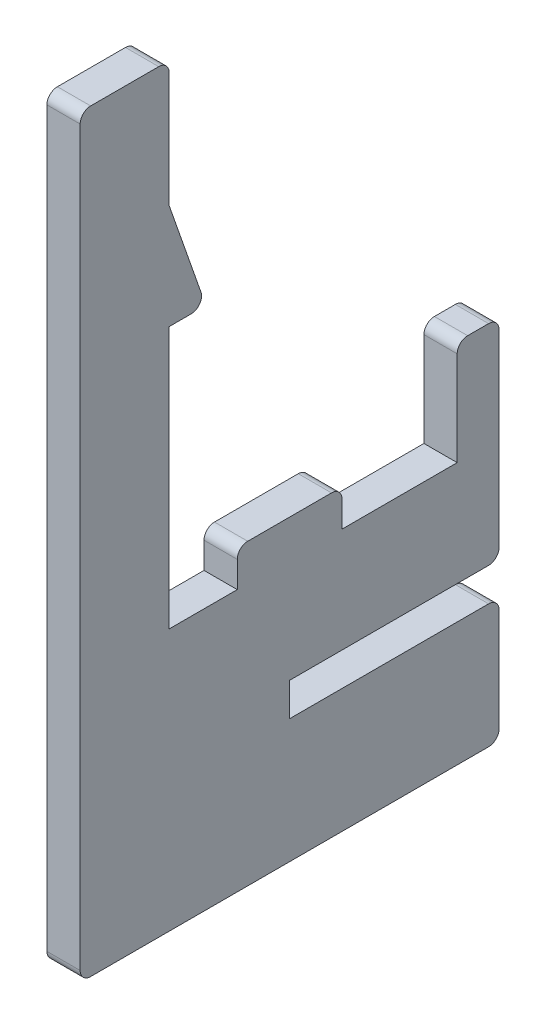
ISO-10303-21;
HEADER;
FILE_DESCRIPTION(('STEP AP214'),'2;1');
FILE_NAME('part.step','',(''),(''),'','','');
FILE_SCHEMA(('AUTOMOTIVE_DESIGN { 1 0 10303 214 1 1 1 1 }'));
ENDSEC;
DATA;
#1=APPLICATION_CONTEXT('core data for automotive mechanical design processes');
#2=APPLICATION_PROTOCOL_DEFINITION('international standard','automotive_design',2000,#1);
#3=PRODUCT_CONTEXT('',#1,'mechanical');
#4=PRODUCT('Part','Part','',(#3));
#5=PRODUCT_RELATED_PRODUCT_CATEGORY('part','',(#4));
#6=PRODUCT_DEFINITION_FORMATION('','',#4);
#7=PRODUCT_DEFINITION_CONTEXT('part definition',#1,'design');
#8=PRODUCT_DEFINITION('design','',#6,#7);
#9=PRODUCT_DEFINITION_SHAPE('','',#8);
#10=(LENGTH_UNIT() NAMED_UNIT(*) SI_UNIT(.MILLI.,.METRE.));
#11=(NAMED_UNIT(*) PLANE_ANGLE_UNIT() SI_UNIT($,.RADIAN.));
#12=(NAMED_UNIT(*) SI_UNIT($,.STERADIAN.) SOLID_ANGLE_UNIT());
#13=UNCERTAINTY_MEASURE_WITH_UNIT(LENGTH_MEASURE(1.E-05),#10,'distance_accuracy_value','');
#14=(GEOMETRIC_REPRESENTATION_CONTEXT(3) GLOBAL_UNCERTAINTY_ASSIGNED_CONTEXT((#13)) GLOBAL_UNIT_ASSIGNED_CONTEXT((#10,
#11,#12)) REPRESENTATION_CONTEXT('',''));
#15=CARTESIAN_POINT('',(0.,0.,0.));
#16=DIRECTION('',(0.,0.,1.));
#17=DIRECTION('',(1.,0.,0.));
#18=AXIS2_PLACEMENT_3D('',#15,#16,#17);
#19=CARTESIAN_POINT('',(3.175,47.,0.));
#20=DIRECTION('',(0.,-1.,0.));
#21=DIRECTION('',(0.,0.,-1.));
#22=AXIS2_PLACEMENT_3D('',#19,#20,#21);
#23=PLANE('',#22);
#24=DIRECTION('',(0.,0.,1.));
#25=VECTOR('',#24,1.);
#26=CARTESIAN_POINT('',(0.,47.,0.));
#27=LINE('',#26,#25);
#28=CARTESIAN_POINT('',(0.,47.,1.));
#29=VERTEX_POINT('',#28);
#30=CARTESIAN_POINT('',(0.,47.,7.5));
#31=VERTEX_POINT('',#30);
#32=EDGE_CURVE('E298',#29,#31,#27,.T.);
#33=ORIENTED_EDGE('',*,*,#32,.T.);
#34=DIRECTION('',(-1.,0.,0.));
#35=VECTOR('',#34,1.);
#36=CARTESIAN_POINT('',(3.175,47.,7.5));
#37=LINE('',#36,#35);
#38=CARTESIAN_POINT('',(3.175,47.,7.5));
#39=VERTEX_POINT('',#38);
#40=EDGE_CURVE('E446',#31,#39,#37,.F.);
#41=ORIENTED_EDGE('',*,*,#40,.T.);
#42=DIRECTION('',(0.,0.,1.));
#43=VECTOR('',#42,1.);
#44=CARTESIAN_POINT('',(3.175,47.,0.));
#45=LINE('',#44,#43);
#46=CARTESIAN_POINT('',(3.175,47.,1.));
#47=VERTEX_POINT('',#46);
#48=EDGE_CURVE('E347',#47,#39,#45,.T.);
#49=ORIENTED_EDGE('',*,*,#48,.F.);
#50=DIRECTION('',(-1.,0.,0.));
#51=VECTOR('',#50,1.);
#52=CARTESIAN_POINT('',(3.175,47.,1.));
#53=LINE('',#52,#51);
#54=EDGE_CURVE('E443',#47,#29,#53,.T.);
#55=ORIENTED_EDGE('',*,*,#54,.T.);
#56=EDGE_LOOP('',(#33,#41,#49,#55));
#57=FACE_BOUND('',#56,.T.);
#58=ADVANCED_FACE('F33',(#57),#23,.F.);
#59=CARTESIAN_POINT('',(3.175,0.,8.5));
#60=DIRECTION('',(0.,0.,-1.));
#61=DIRECTION('',(-1.,0.,0.));
#62=AXIS2_PLACEMENT_3D('',#59,#60,#61);
#63=PLANE('',#62);
#64=DIRECTION('',(0.,-1.,0.));
#65=VECTOR('',#64,1.);
#66=CARTESIAN_POINT('',(0.,0.,8.5));
#67=LINE('',#66,#65);
#68=CARTESIAN_POINT('',(0.,46.,8.5));
#69=VERTEX_POINT('',#68);
#70=CARTESIAN_POINT('',(0.,-24.,8.5));
#71=VERTEX_POINT('',#70);
#72=EDGE_CURVE('E301',#69,#71,#67,.T.);
#73=ORIENTED_EDGE('',*,*,#72,.T.);
#74=DIRECTION('',(-1.,0.,0.));
#75=VECTOR('',#74,1.);
#76=CARTESIAN_POINT('',(3.175,-24.,8.5));
#77=LINE('',#76,#75);
#78=CARTESIAN_POINT('',(3.175,-24.,8.5));
#79=VERTEX_POINT('',#78);
#80=EDGE_CURVE('E417',#71,#79,#77,.F.);
#81=ORIENTED_EDGE('',*,*,#80,.T.);
#82=DIRECTION('',(0.,-1.,0.));
#83=VECTOR('',#82,1.);
#84=CARTESIAN_POINT('',(3.175,0.,8.5));
#85=LINE('',#84,#83);
#86=CARTESIAN_POINT('',(3.175,46.,8.5));
#87=VERTEX_POINT('',#86);
#88=EDGE_CURVE('E527',#87,#79,#85,.T.);
#89=ORIENTED_EDGE('',*,*,#88,.F.);
#90=DIRECTION('',(-1.,0.,0.));
#91=VECTOR('',#90,1.);
#92=CARTESIAN_POINT('',(3.175,46.,8.5));
#93=LINE('',#92,#91);
#94=EDGE_CURVE('E414',#87,#69,#93,.T.);
#95=ORIENTED_EDGE('',*,*,#94,.T.);
#96=EDGE_LOOP('',(#73,#81,#89,#95));
#97=FACE_BOUND('',#96,.T.);
#98=ADVANCED_FACE('F563',(#97),#63,.F.);
#99=CARTESIAN_POINT('',(3.175,-25.,0.));
#100=DIRECTION('',(0.,1.,0.));
#101=DIRECTION('',(0.,0.,1.));
#102=AXIS2_PLACEMENT_3D('',#99,#100,#101);
#103=PLANE('',#102);
#104=DIRECTION('',(0.,0.,-1.));
#105=VECTOR('',#104,1.);
#106=CARTESIAN_POINT('',(3.175,-25.,0.));
#107=LINE('',#106,#105);
#108=CARTESIAN_POINT('',(3.175,-25.,7.5));
#109=VERTEX_POINT('',#108);
#110=CARTESIAN_POINT('',(3.175,-25.,-30.5));
#111=VERTEX_POINT('',#110);
#112=EDGE_CURVE('E530',#109,#111,#107,.T.);
#113=ORIENTED_EDGE('',*,*,#112,.F.);
#114=DIRECTION('',(-1.,0.,0.));
#115=VECTOR('',#114,1.);
#116=CARTESIAN_POINT('',(3.175,-25.,7.5));
#117=LINE('',#116,#115);
#118=CARTESIAN_POINT('',(0.,-25.,7.5));
#119=VERTEX_POINT('',#118);
#120=EDGE_CURVE('E411',#109,#119,#117,.T.);
#121=ORIENTED_EDGE('',*,*,#120,.T.);
#122=DIRECTION('',(0.,0.,-1.));
#123=VECTOR('',#122,1.);
#124=CARTESIAN_POINT('',(0.,-25.,0.));
#125=LINE('',#124,#123);
#126=CARTESIAN_POINT('',(0.,-25.,-30.5));
#127=VERTEX_POINT('',#126);
#128=EDGE_CURVE('E304',#119,#127,#125,.T.);
#129=ORIENTED_EDGE('',*,*,#128,.T.);
#130=DIRECTION('',(-1.,0.,0.));
#131=VECTOR('',#130,1.);
#132=CARTESIAN_POINT('',(3.175,-25.,-30.5));
#133=LINE('',#132,#131);
#134=EDGE_CURVE('E409',#127,#111,#133,.F.);
#135=ORIENTED_EDGE('',*,*,#134,.T.);
#136=EDGE_LOOP('',(#113,#121,#129,#135));
#137=FACE_BOUND('',#136,.T.);
#138=ADVANCED_FACE('F568',(#137),#103,.F.);
#139=CARTESIAN_POINT('',(3.175,0.,-31.5));
#140=DIRECTION('',(0.,0.,1.));
#141=DIRECTION('',(0.,-1.,0.));
#142=AXIS2_PLACEMENT_3D('',#139,#140,#141);
#143=PLANE('',#142);
#144=DIRECTION('',(0.,1.,0.));
#145=VECTOR('',#144,1.);
#146=CARTESIAN_POINT('',(3.175,0.,-31.5));
#147=LINE('',#146,#145);
#148=CARTESIAN_POINT('',(3.175,-24.,-31.5));
#149=VERTEX_POINT('',#148);
#150=CARTESIAN_POINT('',(3.175,-14.175,-31.5));
#151=VERTEX_POINT('',#150);
#152=EDGE_CURVE('E247',#149,#151,#147,.T.);
#153=ORIENTED_EDGE('',*,*,#152,.F.);
#154=DIRECTION('',(-1.,0.,0.));
#155=VECTOR('',#154,1.);
#156=CARTESIAN_POINT('',(3.175,-24.,-31.5));
#157=LINE('',#156,#155);
#158=CARTESIAN_POINT('',(0.,-24.,-31.5));
#159=VERTEX_POINT('',#158);
#160=EDGE_CURVE('E421',#149,#159,#157,.T.);
#161=ORIENTED_EDGE('',*,*,#160,.T.);
#162=DIRECTION('',(0.,1.,0.));
#163=VECTOR('',#162,1.);
#164=CARTESIAN_POINT('',(0.,0.,-31.5));
#165=LINE('',#164,#163);
#166=CARTESIAN_POINT('',(0.,-14.175,-31.5));
#167=VERTEX_POINT('',#166);
#168=EDGE_CURVE('E307',#159,#167,#165,.T.);
#169=ORIENTED_EDGE('',*,*,#168,.T.);
#170=DIRECTION('',(-1.,0.,0.));
#171=VECTOR('',#170,1.);
#172=CARTESIAN_POINT('',(3.175,-14.175,-31.5));
#173=LINE('',#172,#171);
#174=EDGE_CURVE('E419',#167,#151,#173,.F.);
#175=ORIENTED_EDGE('',*,*,#174,.T.);
#176=EDGE_LOOP('',(#153,#161,#169,#175));
#177=FACE_BOUND('',#176,.T.);
#178=ADVANCED_FACE('F605',(#177),#143,.F.);
#179=CARTESIAN_POINT('',(3.175,-13.175,0.));
#180=DIRECTION('',(0.,-1.,0.));
#181=DIRECTION('',(0.,0.,-1.));
#182=AXIS2_PLACEMENT_3D('',#179,#180,#181);
#183=PLANE('',#182);
#184=DIRECTION('',(0.,0.,1.));
#185=VECTOR('',#184,1.);
#186=CARTESIAN_POINT('',(3.175,-13.175,0.));
#187=LINE('',#186,#185);
#188=CARTESIAN_POINT('',(3.175,-13.175,-30.5));
#189=VERTEX_POINT('',#188);
#190=CARTESIAN_POINT('',(3.175,-13.175,-11.5));
#191=VERTEX_POINT('',#190);
#192=EDGE_CURVE('E233',#189,#191,#187,.T.);
#193=ORIENTED_EDGE('',*,*,#192,.F.);
#194=DIRECTION('',(-1.,0.,0.));
#195=VECTOR('',#194,1.);
#196=CARTESIAN_POINT('',(3.175,-13.175,-30.5));
#197=LINE('',#196,#195);
#198=CARTESIAN_POINT('',(0.,-13.175,-30.5));
#199=VERTEX_POINT('',#198);
#200=EDGE_CURVE('E424',#189,#199,#197,.T.);
#201=ORIENTED_EDGE('',*,*,#200,.T.);
#202=DIRECTION('',(0.,0.,1.));
#203=VECTOR('',#202,1.);
#204=CARTESIAN_POINT('',(0.,-13.175,0.));
#205=LINE('',#204,#203);
#206=CARTESIAN_POINT('',(0.,-13.175,-11.5));
#207=VERTEX_POINT('',#206);
#208=EDGE_CURVE('E253',#199,#207,#205,.T.);
#209=ORIENTED_EDGE('',*,*,#208,.T.);
#210=DIRECTION('',(-1.,0.,0.));
#211=VECTOR('',#210,1.);
#212=CARTESIAN_POINT('',(3.175,-13.175,-11.5));
#213=LINE('',#212,#211);
#214=EDGE_CURVE('E250',#191,#207,#213,.T.);
#215=ORIENTED_EDGE('',*,*,#214,.F.);
#216=EDGE_LOOP('',(#193,#201,#209,#215));
#217=FACE_BOUND('',#216,.T.);
#218=ADVANCED_FACE('F251',(#217),#183,.F.);
#219=CARTESIAN_POINT('',(3.175,0.,-11.5));
#220=DIRECTION('',(0.,0.,1.));
#221=DIRECTION('',(1.,0.,0.));
#222=AXIS2_PLACEMENT_3D('',#219,#220,#221);
#223=PLANE('',#222);
#224=DIRECTION('',(0.,1.,0.));
#225=VECTOR('',#224,1.);
#226=CARTESIAN_POINT('',(0.,0.,-11.5));
#227=LINE('',#226,#225);
#228=CARTESIAN_POINT('',(0.,-10.,-11.5));
#229=VERTEX_POINT('',#228);
#230=EDGE_CURVE('E311',#207,#229,#227,.T.);
#231=ORIENTED_EDGE('',*,*,#230,.T.);
#232=DIRECTION('',(-1.,0.,0.));
#233=VECTOR('',#232,1.);
#234=CARTESIAN_POINT('',(3.175,-10.,-11.5));
#235=LINE('',#234,#233);
#236=CARTESIAN_POINT('',(3.175,-10.,-11.5));
#237=VERTEX_POINT('',#236);
#238=EDGE_CURVE('E258',#237,#229,#235,.T.);
#239=ORIENTED_EDGE('',*,*,#238,.F.);
#240=DIRECTION('',(0.,1.,0.));
#241=VECTOR('',#240,1.);
#242=CARTESIAN_POINT('',(3.175,0.,-11.5));
#243=LINE('',#242,#241);
#244=EDGE_CURVE('E239',#191,#237,#243,.T.);
#245=ORIENTED_EDGE('',*,*,#244,.F.);
#246=ORIENTED_EDGE('',*,*,#214,.T.);
#247=EDGE_LOOP('',(#231,#239,#245,#246));
#248=FACE_BOUND('',#247,.T.);
#249=ADVANCED_FACE('F260',(#248),#223,.F.);
#250=CARTESIAN_POINT('',(3.175,-10.,0.));
#251=DIRECTION('',(0.,-1.,0.));
#252=DIRECTION('',(0.,0.,-1.));
#253=AXIS2_PLACEMENT_3D('',#250,#251,#252);
#254=PLANE('',#253);
#255=DIRECTION('',(0.,0.,1.));
#256=VECTOR('',#255,1.);
#257=CARTESIAN_POINT('',(0.,-10.,0.));
#258=LINE('',#257,#256);
#259=CARTESIAN_POINT('',(0.,-10.,-30.5));
#260=VERTEX_POINT('',#259);
#261=EDGE_CURVE('E313',#260,#229,#258,.T.);
#262=ORIENTED_EDGE('',*,*,#261,.F.);
#263=DIRECTION('',(-1.,0.,0.));
#264=VECTOR('',#263,1.);
#265=CARTESIAN_POINT('',(3.175,-10.,-30.5));
#266=LINE('',#265,#264);
#267=CARTESIAN_POINT('',(3.175,-10.,-30.5));
#268=VERTEX_POINT('',#267);
#269=EDGE_CURVE('E431',#260,#268,#266,.F.);
#270=ORIENTED_EDGE('',*,*,#269,.T.);
#271=DIRECTION('',(0.,0.,1.));
#272=VECTOR('',#271,1.);
#273=CARTESIAN_POINT('',(3.175,-10.,0.));
#274=LINE('',#273,#272);
#275=EDGE_CURVE('E262',#268,#237,#274,.T.);
#276=ORIENTED_EDGE('',*,*,#275,.T.);
#277=ORIENTED_EDGE('',*,*,#238,.T.);
#278=EDGE_LOOP('',(#262,#270,#276,#277));
#279=FACE_BOUND('',#278,.T.);
#280=ADVANCED_FACE('F545',(#279),#254,.T.);
#281=CARTESIAN_POINT('',(3.175,0.,-31.5));
#282=DIRECTION('',(0.,0.,-1.));
#283=DIRECTION('',(-1.,0.,0.));
#284=AXIS2_PLACEMENT_3D('',#281,#282,#283);
#285=PLANE('',#284);
#286=DIRECTION('',(0.,-1.,0.));
#287=VECTOR('',#286,1.);
#288=CARTESIAN_POINT('',(3.175,0.,-31.5));
#289=LINE('',#288,#287);
#290=CARTESIAN_POINT('',(3.175,9.,-31.5));
#291=VERTEX_POINT('',#290);
#292=CARTESIAN_POINT('',(3.175,-9.,-31.5));
#293=VERTEX_POINT('',#292);
#294=EDGE_CURVE('E264',#291,#293,#289,.T.);
#295=ORIENTED_EDGE('',*,*,#294,.T.);
#296=DIRECTION('',(-1.,0.,0.));
#297=VECTOR('',#296,1.);
#298=CARTESIAN_POINT('',(3.175,-9.,-31.5));
#299=LINE('',#298,#297);
#300=CARTESIAN_POINT('',(0.,-9.,-31.5));
#301=VERTEX_POINT('',#300);
#302=EDGE_CURVE('E428',#293,#301,#299,.T.);
#303=ORIENTED_EDGE('',*,*,#302,.T.);
#304=DIRECTION('',(0.,-1.,0.));
#305=VECTOR('',#304,1.);
#306=CARTESIAN_POINT('',(0.,0.,-31.5));
#307=LINE('',#306,#305);
#308=CARTESIAN_POINT('',(0.,9.,-31.5));
#309=VERTEX_POINT('',#308);
#310=EDGE_CURVE('E315',#309,#301,#307,.T.);
#311=ORIENTED_EDGE('',*,*,#310,.F.);
#312=DIRECTION('',(-1.,0.,0.));
#313=VECTOR('',#312,1.);
#314=CARTESIAN_POINT('',(3.175,9.,-31.5));
#315=LINE('',#314,#313);
#316=EDGE_CURVE('E426',#309,#291,#315,.F.);
#317=ORIENTED_EDGE('',*,*,#316,.T.);
#318=EDGE_LOOP('',(#295,#303,#311,#317));
#319=FACE_BOUND('',#318,.T.);
#320=ADVANCED_FACE('F552',(#319),#285,.T.);
#321=CARTESIAN_POINT('',(3.175,10.,0.));
#322=DIRECTION('',(0.,1.,0.));
#323=DIRECTION('',(0.,0.,1.));
#324=AXIS2_PLACEMENT_3D('',#321,#322,#323);
#325=PLANE('',#324);
#326=DIRECTION('',(0.,0.,-1.));
#327=VECTOR('',#326,1.);
#328=CARTESIAN_POINT('',(3.175,10.,0.));
#329=LINE('',#328,#327);
#330=CARTESIAN_POINT('',(3.175,10.,-28.5));
#331=VERTEX_POINT('',#330);
#332=CARTESIAN_POINT('',(3.175,10.,-30.5));
#333=VERTEX_POINT('',#332);
#334=EDGE_CURVE('E270',#331,#333,#329,.T.);
#335=ORIENTED_EDGE('',*,*,#334,.T.);
#336=DIRECTION('',(-1.,0.,0.));
#337=VECTOR('',#336,1.);
#338=CARTESIAN_POINT('',(3.175,10.,-30.5));
#339=LINE('',#338,#337);
#340=CARTESIAN_POINT('',(0.,10.,-30.5));
#341=VERTEX_POINT('',#340);
#342=EDGE_CURVE('E41',#333,#341,#339,.T.);
#343=ORIENTED_EDGE('',*,*,#342,.T.);
#344=DIRECTION('',(0.,0.,-1.));
#345=VECTOR('',#344,1.);
#346=CARTESIAN_POINT('',(0.,10.,0.));
#347=LINE('',#346,#345);
#348=CARTESIAN_POINT('',(0.,10.,-28.5));
#349=VERTEX_POINT('',#348);
#350=EDGE_CURVE('E318',#349,#341,#347,.T.);
#351=ORIENTED_EDGE('',*,*,#350,.F.);
#352=DIRECTION('',(-1.,0.,0.));
#353=VECTOR('',#352,1.);
#354=CARTESIAN_POINT('',(3.175,10.,-28.5));
#355=LINE('',#354,#353);
#356=EDGE_CURVE('E449',#349,#331,#355,.F.);
#357=ORIENTED_EDGE('',*,*,#356,.T.);
#358=EDGE_LOOP('',(#335,#343,#351,#357));
#359=FACE_BOUND('',#358,.T.);
#360=ADVANCED_FACE('F454',(#359),#325,.T.);
#361=CARTESIAN_POINT('',(3.175,0.,-27.5));
#362=DIRECTION('',(0.,0.,1.));
#363=DIRECTION('',(1.,0.,0.));
#364=AXIS2_PLACEMENT_3D('',#361,#362,#363);
#365=PLANE('',#364);
#366=DIRECTION('',(0.,1.,0.));
#367=VECTOR('',#366,1.);
#368=CARTESIAN_POINT('',(3.175,0.,-27.5));
#369=LINE('',#368,#367);
#370=CARTESIAN_POINT('',(3.175,0.,-27.5));
#371=VERTEX_POINT('',#370);
#372=CARTESIAN_POINT('',(3.175,9.,-27.5));
#373=VERTEX_POINT('',#372);
#374=EDGE_CURVE('E273',#371,#373,#369,.T.);
#375=ORIENTED_EDGE('',*,*,#374,.T.);
#376=DIRECTION('',(-1.,0.,0.));
#377=VECTOR('',#376,1.);
#378=CARTESIAN_POINT('',(3.175,9.,-27.5));
#379=LINE('',#378,#377);
#380=CARTESIAN_POINT('',(0.,9.,-27.5));
#381=VERTEX_POINT('',#380);
#382=EDGE_CURVE('E11',#373,#381,#379,.T.);
#383=ORIENTED_EDGE('',*,*,#382,.T.);
#384=DIRECTION('',(0.,1.,0.));
#385=VECTOR('',#384,1.);
#386=CARTESIAN_POINT('',(0.,0.,-27.5));
#387=LINE('',#386,#385);
#388=CARTESIAN_POINT('',(0.,0.,-27.5));
#389=VERTEX_POINT('',#388);
#390=EDGE_CURVE('E321',#389,#381,#387,.T.);
#391=ORIENTED_EDGE('',*,*,#390,.F.);
#392=DIRECTION('',(-1.,0.,0.));
#393=VECTOR('',#392,1.);
#394=CARTESIAN_POINT('',(3.175,0.,-27.5));
#395=LINE('',#394,#393);
#396=EDGE_CURVE('E360',#371,#389,#395,.T.);
#397=ORIENTED_EDGE('',*,*,#396,.F.);
#398=EDGE_LOOP('',(#375,#383,#391,#397));
#399=FACE_BOUND('',#398,.T.);
#400=ADVANCED_FACE('F468',(#399),#365,.T.);
#401=CARTESIAN_POINT('',(3.175,0.,0.));
#402=DIRECTION('',(0.,1.,0.));
#403=DIRECTION('',(0.,0.,1.));
#404=AXIS2_PLACEMENT_3D('',#401,#402,#403);
#405=PLANE('',#404);
#406=DIRECTION('',(0.,0.,-1.));
#407=VECTOR('',#406,1.);
#408=CARTESIAN_POINT('',(0.,0.,0.));
#409=LINE('',#408,#407);
#410=CARTESIAN_POINT('',(0.,0.,-16.5));
#411=VERTEX_POINT('',#410);
#412=EDGE_CURVE('E324',#411,#389,#409,.T.);
#413=ORIENTED_EDGE('',*,*,#412,.F.);
#414=DIRECTION('',(-1.,0.,0.));
#415=VECTOR('',#414,1.);
#416=CARTESIAN_POINT('',(3.175,0.,-16.5));
#417=LINE('',#416,#415);
#418=CARTESIAN_POINT('',(3.175,0.,-16.5));
#419=VERTEX_POINT('',#418);
#420=EDGE_CURVE('E357',#419,#411,#417,.T.);
#421=ORIENTED_EDGE('',*,*,#420,.F.);
#422=DIRECTION('',(0.,0.,-1.));
#423=VECTOR('',#422,1.);
#424=CARTESIAN_POINT('',(3.175,0.,0.));
#425=LINE('',#424,#423);
#426=EDGE_CURVE('E276',#419,#371,#425,.T.);
#427=ORIENTED_EDGE('',*,*,#426,.T.);
#428=ORIENTED_EDGE('',*,*,#396,.T.);
#429=EDGE_LOOP('',(#413,#421,#427,#428));
#430=FACE_BOUND('',#429,.T.);
#431=ADVANCED_FACE('F475',(#430),#405,.T.);
#432=CARTESIAN_POINT('',(3.175,0.,-16.5));
#433=DIRECTION('',(0.,0.,-1.));
#434=DIRECTION('',(-1.,0.,0.));
#435=AXIS2_PLACEMENT_3D('',#432,#433,#434);
#436=PLANE('',#435);
#437=DIRECTION('',(0.,-1.,0.));
#438=VECTOR('',#437,1.);
#439=CARTESIAN_POINT('',(0.,0.,-16.5));
#440=LINE('',#439,#438);
#441=CARTESIAN_POINT('',(0.,2.5,-16.5));
#442=VERTEX_POINT('',#441);
#443=EDGE_CURVE('E327',#442,#411,#440,.T.);
#444=ORIENTED_EDGE('',*,*,#443,.F.);
#445=DIRECTION('',(-1.,0.,0.));
#446=VECTOR('',#445,1.);
#447=CARTESIAN_POINT('',(3.175,2.5,-16.5));
#448=LINE('',#447,#446);
#449=CARTESIAN_POINT('',(3.175,2.5,-16.5));
#450=VERTEX_POINT('',#449);
#451=EDGE_CURVE('E441',#442,#450,#448,.F.);
#452=ORIENTED_EDGE('',*,*,#451,.T.);
#453=DIRECTION('',(0.,-1.,0.));
#454=VECTOR('',#453,1.);
#455=CARTESIAN_POINT('',(3.175,0.,-16.5));
#456=LINE('',#455,#454);
#457=EDGE_CURVE('E279',#450,#419,#456,.T.);
#458=ORIENTED_EDGE('',*,*,#457,.T.);
#459=ORIENTED_EDGE('',*,*,#420,.T.);
#460=EDGE_LOOP('',(#444,#452,#458,#459));
#461=FACE_BOUND('',#460,.T.);
#462=ADVANCED_FACE('F478',(#461),#436,.T.);
#463=CARTESIAN_POINT('',(3.175,3.5,0.));
#464=DIRECTION('',(0.,1.,0.));
#465=DIRECTION('',(0.,0.,1.));
#466=AXIS2_PLACEMENT_3D('',#463,#464,#465);
#467=PLANE('',#466);
#468=DIRECTION('',(0.,0.,-1.));
#469=VECTOR('',#468,1.);
#470=CARTESIAN_POINT('',(0.,3.5,0.));
#471=LINE('',#470,#469);
#472=CARTESIAN_POINT('',(0.,3.5,-7.5));
#473=VERTEX_POINT('',#472);
#474=CARTESIAN_POINT('',(0.,3.5,-15.5));
#475=VERTEX_POINT('',#474);
#476=EDGE_CURVE('E329',#473,#475,#471,.T.);
#477=ORIENTED_EDGE('',*,*,#476,.F.);
#478=DIRECTION('',(-1.,0.,0.));
#479=VECTOR('',#478,1.);
#480=CARTESIAN_POINT('',(3.175,3.5,-7.5));
#481=LINE('',#480,#479);
#482=CARTESIAN_POINT('',(3.175,3.5,-7.5));
#483=VERTEX_POINT('',#482);
#484=EDGE_CURVE('E439',#473,#483,#481,.F.);
#485=ORIENTED_EDGE('',*,*,#484,.T.);
#486=DIRECTION('',(0.,0.,-1.));
#487=VECTOR('',#486,1.);
#488=CARTESIAN_POINT('',(3.175,3.5,0.));
#489=LINE('',#488,#487);
#490=CARTESIAN_POINT('',(3.175,3.5,-15.5));
#491=VERTEX_POINT('',#490);
#492=EDGE_CURVE('E281',#483,#491,#489,.T.);
#493=ORIENTED_EDGE('',*,*,#492,.T.);
#494=DIRECTION('',(-1.,0.,0.));
#495=VECTOR('',#494,1.);
#496=CARTESIAN_POINT('',(3.175,3.5,-15.5));
#497=LINE('',#496,#495);
#498=EDGE_CURVE('E436',#491,#475,#497,.T.);
#499=ORIENTED_EDGE('',*,*,#498,.T.);
#500=EDGE_LOOP('',(#477,#485,#493,#499));
#501=FACE_BOUND('',#500,.T.);
#502=ADVANCED_FACE('F486',(#501),#467,.T.);
#503=CARTESIAN_POINT('',(3.175,0.,-6.5));
#504=DIRECTION('',(0.,0.,1.));
#505=DIRECTION('',(1.,0.,0.));
#506=AXIS2_PLACEMENT_3D('',#503,#504,#505);
#507=PLANE('',#506);
#508=DIRECTION('',(0.,1.,0.));
#509=VECTOR('',#508,1.);
#510=CARTESIAN_POINT('',(3.175,0.,-6.5));
#511=LINE('',#510,#509);
#512=CARTESIAN_POINT('',(3.175,0.,-6.5));
#513=VERTEX_POINT('',#512);
#514=CARTESIAN_POINT('',(3.175,2.5,-6.5));
#515=VERTEX_POINT('',#514);
#516=EDGE_CURVE('E284',#513,#515,#511,.T.);
#517=ORIENTED_EDGE('',*,*,#516,.T.);
#518=DIRECTION('',(-1.,0.,0.));
#519=VECTOR('',#518,1.);
#520=CARTESIAN_POINT('',(3.175,2.5,-6.5));
#521=LINE('',#520,#519);
#522=CARTESIAN_POINT('',(0.,2.5,-6.5));
#523=VERTEX_POINT('',#522);
#524=EDGE_CURVE('E433',#515,#523,#521,.T.);
#525=ORIENTED_EDGE('',*,*,#524,.T.);
#526=DIRECTION('',(0.,1.,0.));
#527=VECTOR('',#526,1.);
#528=CARTESIAN_POINT('',(0.,0.,-6.5));
#529=LINE('',#528,#527);
#530=CARTESIAN_POINT('',(0.,0.,-6.5));
#531=VERTEX_POINT('',#530);
#532=EDGE_CURVE('E332',#531,#523,#529,.T.);
#533=ORIENTED_EDGE('',*,*,#532,.F.);
#534=DIRECTION('',(-1.,0.,0.));
#535=VECTOR('',#534,1.);
#536=CARTESIAN_POINT('',(3.175,0.,-6.5));
#537=LINE('',#536,#535);
#538=EDGE_CURVE('E355',#513,#531,#537,.T.);
#539=ORIENTED_EDGE('',*,*,#538,.F.);
#540=EDGE_LOOP('',(#517,#525,#533,#539));
#541=FACE_BOUND('',#540,.T.);
#542=ADVANCED_FACE('F493',(#541),#507,.T.);
#543=CARTESIAN_POINT('',(3.175,0.,0.));
#544=DIRECTION('',(0.,1.,0.));
#545=DIRECTION('',(0.,0.,1.));
#546=AXIS2_PLACEMENT_3D('',#543,#544,#545);
#547=PLANE('',#546);
#548=DIRECTION('',(0.,0.,-1.));
#549=VECTOR('',#548,1.);
#550=CARTESIAN_POINT('',(0.,0.,0.));
#551=LINE('',#550,#549);
#552=CARTESIAN_POINT('',(0.,0.,0.));
#553=VERTEX_POINT('',#552);
#554=EDGE_CURVE('E335',#553,#531,#551,.T.);
#555=ORIENTED_EDGE('',*,*,#554,.F.);
#556=DIRECTION('',(-1.,0.,0.));
#557=VECTOR('',#556,1.);
#558=CARTESIAN_POINT('',(3.175,0.,0.));
#559=LINE('',#558,#557);
#560=CARTESIAN_POINT('',(3.175,0.,0.));
#561=VERTEX_POINT('',#560);
#562=EDGE_CURVE('E353',#561,#553,#559,.T.);
#563=ORIENTED_EDGE('',*,*,#562,.F.);
#564=DIRECTION('',(0.,0.,-1.));
#565=VECTOR('',#564,1.);
#566=CARTESIAN_POINT('',(3.175,0.,0.));
#567=LINE('',#566,#565);
#568=EDGE_CURVE('E286',#561,#513,#567,.T.);
#569=ORIENTED_EDGE('',*,*,#568,.T.);
#570=ORIENTED_EDGE('',*,*,#538,.T.);
#571=EDGE_LOOP('',(#555,#563,#569,#570));
#572=FACE_BOUND('',#571,.T.);
#573=ADVANCED_FACE('F497',(#572),#547,.T.);
#574=CARTESIAN_POINT('',(3.175,0.,0.));
#575=DIRECTION('',(0.,0.,1.));
#576=DIRECTION('',(1.,0.,0.));
#577=AXIS2_PLACEMENT_3D('',#574,#575,#576);
#578=PLANE('',#577);
#579=DIRECTION('',(0.,1.,0.));
#580=VECTOR('',#579,1.);
#581=CARTESIAN_POINT('',(0.,0.,0.));
#582=LINE('',#581,#580);
#583=CARTESIAN_POINT('',(0.,25.,0.));
#584=VERTEX_POINT('',#583);
#585=EDGE_CURVE('E338',#553,#584,#582,.T.);
#586=ORIENTED_EDGE('',*,*,#585,.T.);
#587=DIRECTION('',(-1.,0.,0.));
#588=VECTOR('',#587,1.);
#589=CARTESIAN_POINT('',(3.175,25.,0.));
#590=LINE('',#589,#588);
#591=CARTESIAN_POINT('',(3.175,25.,0.));
#592=VERTEX_POINT('',#591);
#593=EDGE_CURVE('E350',#592,#584,#590,.T.);
#594=ORIENTED_EDGE('',*,*,#593,.F.);
#595=DIRECTION('',(0.,1.,0.));
#596=VECTOR('',#595,1.);
#597=CARTESIAN_POINT('',(3.175,0.,0.));
#598=LINE('',#597,#596);
#599=EDGE_CURVE('E289',#561,#592,#598,.T.);
#600=ORIENTED_EDGE('',*,*,#599,.F.);
#601=ORIENTED_EDGE('',*,*,#562,.T.);
#602=EDGE_LOOP('',(#586,#594,#600,#601));
#603=FACE_BOUND('',#602,.T.);
#604=ADVANCED_FACE('F502',(#603),#578,.F.);
#605=CARTESIAN_POINT('',(3.175,25.,0.));
#606=DIRECTION('',(0.,1.,0.));
#607=DIRECTION('',(0.,0.,1.));
#608=AXIS2_PLACEMENT_3D('',#605,#606,#607);
#609=PLANE('',#608);
#610=DIRECTION('',(0.,0.,-1.));
#611=VECTOR('',#610,1.);
#612=CARTESIAN_POINT('',(0.,25.,0.));
#613=LINE('',#612,#611);
#614=CARTESIAN_POINT('',(0.,25.,-2.09051899497915));
#615=VERTEX_POINT('',#614);
#616=EDGE_CURVE('E340',#584,#615,#613,.T.);
#617=ORIENTED_EDGE('',*,*,#616,.T.);
#618=DIRECTION('',(-1.,0.,0.));
#619=VECTOR('',#618,1.);
#620=CARTESIAN_POINT('',(3.175,25.,-2.09051899497915));
#621=LINE('',#620,#619);
#622=CARTESIAN_POINT('',(3.175,25.,-2.09051899497915));
#623=VERTEX_POINT('',#622);
#624=EDGE_CURVE('E387',#615,#623,#621,.F.);
#625=ORIENTED_EDGE('',*,*,#624,.T.);
#626=DIRECTION('',(0.,0.,-1.));
#627=VECTOR('',#626,1.);
#628=CARTESIAN_POINT('',(3.175,25.,0.));
#629=LINE('',#628,#627);
#630=EDGE_CURVE('E291',#592,#623,#629,.T.);
#631=ORIENTED_EDGE('',*,*,#630,.F.);
#632=ORIENTED_EDGE('',*,*,#593,.T.);
#633=EDGE_LOOP('',(#617,#625,#631,#632));
#634=FACE_BOUND('',#633,.T.);
#635=ADVANCED_FACE('F636',(#634),#609,.F.);
#636=CARTESIAN_POINT('',(3.175,3.8195991091314,-10.913140311804));
#637=DIRECTION('',(0.,-0.330350424728106,0.943858356366017));
#638=DIRECTION('',(0.,-0.943858356366018,-0.330350424728106));
#639=AXIS2_PLACEMENT_3D('',#636,#637,#638);
#640=PLANE('',#639);
#641=DIRECTION('',(0.,0.943858356366018,0.330350424728106));
#642=VECTOR('',#641,1.);
#643=CARTESIAN_POINT('',(3.175,3.8195991091314,-10.913140311804));
#644=LINE('',#643,#642);
#645=CARTESIAN_POINT('',(3.175,26.3303504247281,-3.03437735134516));
#646=VERTEX_POINT('',#645);
#647=CARTESIAN_POINT('',(3.175,35.,0.));
#648=VERTEX_POINT('',#647);
#649=EDGE_CURVE('E293',#646,#648,#644,.T.);
#650=ORIENTED_EDGE('',*,*,#649,.F.);
#651=DIRECTION('',(-1.,0.,0.));
#652=VECTOR('',#651,1.);
#653=CARTESIAN_POINT('',(3.175,26.3303504247281,-3.03437735134516));
#654=LINE('',#653,#652);
#655=CARTESIAN_POINT('',(0.,26.3303504247281,-3.03437735134516));
#656=VERTEX_POINT('',#655);
#657=EDGE_CURVE('E257',#646,#656,#654,.T.);
#658=ORIENTED_EDGE('',*,*,#657,.T.);
#659=DIRECTION('',(0.,0.943858356366018,0.330350424728106));
#660=VECTOR('',#659,1.);
#661=CARTESIAN_POINT('',(0.,3.8195991091314,-10.913140311804));
#662=LINE('',#661,#660);
#663=CARTESIAN_POINT('',(0.,35.,0.));
#664=VERTEX_POINT('',#663);
#665=EDGE_CURVE('E343',#656,#664,#662,.T.);
#666=ORIENTED_EDGE('',*,*,#665,.T.);
#667=DIRECTION('',(-1.,0.,0.));
#668=VECTOR('',#667,1.);
#669=CARTESIAN_POINT('',(3.175,35.,0.));
#670=LINE('',#669,#668);
#671=EDGE_CURVE('E297',#648,#664,#670,.T.);
#672=ORIENTED_EDGE('',*,*,#671,.F.);
#673=EDGE_LOOP('',(#650,#658,#666,#672));
#674=FACE_BOUND('',#673,.T.);
#675=ADVANCED_FACE('F512',(#674),#640,.F.);
#676=CARTESIAN_POINT('',(3.175,0.,0.));
#677=DIRECTION('',(0.,0.,1.));
#678=DIRECTION('',(1.,0.,0.));
#679=AXIS2_PLACEMENT_3D('',#676,#677,#678);
#680=PLANE('',#679);
#681=DIRECTION('',(0.,1.,0.));
#682=VECTOR('',#681,1.);
#683=CARTESIAN_POINT('',(0.,0.,0.));
#684=LINE('',#683,#682);
#685=CARTESIAN_POINT('',(0.,46.,0.));
#686=VERTEX_POINT('',#685);
#687=EDGE_CURVE('E345',#664,#686,#684,.T.);
#688=ORIENTED_EDGE('',*,*,#687,.T.);
#689=DIRECTION('',(-1.,0.,0.));
#690=VECTOR('',#689,1.);
#691=CARTESIAN_POINT('',(3.175,46.,0.));
#692=LINE('',#691,#690);
#693=CARTESIAN_POINT('',(3.175,46.,0.));
#694=VERTEX_POINT('',#693);
#695=EDGE_CURVE('E48',#686,#694,#692,.F.);
#696=ORIENTED_EDGE('',*,*,#695,.T.);
#697=DIRECTION('',(0.,1.,0.));
#698=VECTOR('',#697,1.);
#699=CARTESIAN_POINT('',(3.175,0.,0.));
#700=LINE('',#699,#698);
#701=EDGE_CURVE('E295',#648,#694,#700,.T.);
#702=ORIENTED_EDGE('',*,*,#701,.F.);
#703=ORIENTED_EDGE('',*,*,#671,.T.);
#704=EDGE_LOOP('',(#688,#696,#702,#703));
#705=FACE_BOUND('',#704,.T.);
#706=ADVANCED_FACE('F517',(#705),#680,.F.);
#707=CARTESIAN_POINT('',(3.175,0.,0.));
#708=DIRECTION('',(1.,0.,0.));
#709=DIRECTION('',(0.,0.,-1.));
#710=AXIS2_PLACEMENT_3D('',#707,#708,#709);
#711=PLANE('',#710);
#712=ORIENTED_EDGE('',*,*,#630,.T.);
#713=CARTESIAN_POINT('',(3.175,26.,-2.09051899497915));
#714=DIRECTION('',(1.,0.,0.));
#715=DIRECTION('',(0.,0.,-1.));
#716=AXIS2_PLACEMENT_3D('',#713,#714,#715);
#717=CIRCLE('',#716,1.);
#718=EDGE_CURVE('E407',#623,#646,#717,.T.);
#719=ORIENTED_EDGE('',*,*,#718,.T.);
#720=ORIENTED_EDGE('',*,*,#649,.T.);
#721=ORIENTED_EDGE('',*,*,#701,.T.);
#722=CARTESIAN_POINT('',(3.175,46.,1.));
#723=DIRECTION('',(1.,0.,0.));
#724=DIRECTION('',(0.,0.,-1.));
#725=AXIS2_PLACEMENT_3D('',#722,#723,#724);
#726=CIRCLE('',#725,1.);
#727=EDGE_CURVE('E393',#694,#47,#726,.T.);
#728=ORIENTED_EDGE('',*,*,#727,.T.);
#729=ORIENTED_EDGE('',*,*,#48,.T.);
#730=CARTESIAN_POINT('',(3.175,46.,7.5));
#731=DIRECTION('',(1.,0.,0.));
#732=DIRECTION('',(0.,0.,-1.));
#733=AXIS2_PLACEMENT_3D('',#730,#731,#732);
#734=CIRCLE('',#733,1.);
#735=EDGE_CURVE('E395',#39,#87,#734,.T.);
#736=ORIENTED_EDGE('',*,*,#735,.T.);
#737=ORIENTED_EDGE('',*,*,#88,.T.);
#738=CARTESIAN_POINT('',(3.175,-24.,7.5));
#739=DIRECTION('',(1.,0.,0.));
#740=DIRECTION('',(0.,0.,-1.));
#741=AXIS2_PLACEMENT_3D('',#738,#739,#740);
#742=CIRCLE('',#741,1.);
#743=EDGE_CURVE('E405',#79,#109,#742,.T.);
#744=ORIENTED_EDGE('',*,*,#743,.T.);
#745=ORIENTED_EDGE('',*,*,#112,.T.);
#746=CARTESIAN_POINT('',(3.175,-24.,-30.5));
#747=DIRECTION('',(1.,0.,0.));
#748=DIRECTION('',(0.,0.,-1.));
#749=AXIS2_PLACEMENT_3D('',#746,#747,#748);
#750=CIRCLE('',#749,1.);
#751=EDGE_CURVE('E403',#111,#149,#750,.T.);
#752=ORIENTED_EDGE('',*,*,#751,.T.);
#753=ORIENTED_EDGE('',*,*,#152,.T.);
#754=CARTESIAN_POINT('',(3.175,-14.175,-30.5));
#755=DIRECTION('',(1.,0.,0.));
#756=DIRECTION('',(0.,0.,-1.));
#757=AXIS2_PLACEMENT_3D('',#754,#755,#756);
#758=CIRCLE('',#757,1.);
#759=EDGE_CURVE('E243',#151,#189,#758,.T.);
#760=ORIENTED_EDGE('',*,*,#759,.T.);
#761=ORIENTED_EDGE('',*,*,#192,.T.);
#762=ORIENTED_EDGE('',*,*,#244,.T.);
#763=ORIENTED_EDGE('',*,*,#275,.F.);
#764=CARTESIAN_POINT('',(3.175,-9.,-30.5));
#765=DIRECTION('',(1.,0.,0.));
#766=DIRECTION('',(0.,0.,-1.));
#767=AXIS2_PLACEMENT_3D('',#764,#765,#766);
#768=CIRCLE('',#767,1.);
#769=EDGE_CURVE('E400',#268,#293,#768,.T.);
#770=ORIENTED_EDGE('',*,*,#769,.T.);
#771=ORIENTED_EDGE('',*,*,#294,.F.);
#772=CARTESIAN_POINT('',(3.175,9.,-30.5));
#773=DIRECTION('',(1.,0.,0.));
#774=DIRECTION('',(0.,0.,-1.));
#775=AXIS2_PLACEMENT_3D('',#772,#773,#774);
#776=CIRCLE('',#775,1.);
#777=EDGE_CURVE('E391',#291,#333,#776,.T.);
#778=ORIENTED_EDGE('',*,*,#777,.T.);
#779=ORIENTED_EDGE('',*,*,#334,.F.);
#780=CARTESIAN_POINT('',(3.175,9.,-28.5));
#781=DIRECTION('',(1.,0.,0.));
#782=DIRECTION('',(0.,0.,-1.));
#783=AXIS2_PLACEMENT_3D('',#780,#781,#782);
#784=CIRCLE('',#783,1.);
#785=EDGE_CURVE('E389',#331,#373,#784,.T.);
#786=ORIENTED_EDGE('',*,*,#785,.T.);
#787=ORIENTED_EDGE('',*,*,#374,.F.);
#788=ORIENTED_EDGE('',*,*,#426,.F.);
#789=ORIENTED_EDGE('',*,*,#457,.F.);
#790=CARTESIAN_POINT('',(3.175,2.5,-15.5));
#791=DIRECTION('',(1.,0.,0.));
#792=DIRECTION('',(0.,0.,-1.));
#793=AXIS2_PLACEMENT_3D('',#790,#791,#792);
#794=CIRCLE('',#793,1.);
#795=EDGE_CURVE('E397',#450,#491,#794,.T.);
#796=ORIENTED_EDGE('',*,*,#795,.T.);
#797=ORIENTED_EDGE('',*,*,#492,.F.);
#798=CARTESIAN_POINT('',(3.175,2.5,-7.5));
#799=DIRECTION('',(1.,0.,0.));
#800=DIRECTION('',(0.,0.,-1.));
#801=AXIS2_PLACEMENT_3D('',#798,#799,#800);
#802=CIRCLE('',#801,1.);
#803=EDGE_CURVE('E56',#483,#515,#802,.T.);
#804=ORIENTED_EDGE('',*,*,#803,.T.);
#805=ORIENTED_EDGE('',*,*,#516,.F.);
#806=ORIENTED_EDGE('',*,*,#568,.F.);
#807=ORIENTED_EDGE('',*,*,#599,.T.);
#808=EDGE_LOOP('',(#712,#719,#720,#721,#728,#729,#736,#737,#744,#745,#752,#753,#760,#761,#762,
#763,#770,#771,#778,#779,#786,#787,#788,#789,#796,#797,#804,#805,#806,#807));
#809=FACE_BOUND('',#808,.T.);
#810=ADVANCED_FACE('F236',(#809),#711,.T.);
#811=CARTESIAN_POINT('',(0.,0.,0.));
#812=DIRECTION('',(1.,0.,0.));
#813=DIRECTION('',(0.,0.,-1.));
#814=AXIS2_PLACEMENT_3D('',#811,#812,#813);
#815=PLANE('',#814);
#816=ORIENTED_EDGE('',*,*,#665,.F.);
#817=CARTESIAN_POINT('',(0.,26.,-2.09051899497915));
#818=DIRECTION('',(1.,0.,0.));
#819=DIRECTION('',(0.,0.,-1.));
#820=AXIS2_PLACEMENT_3D('',#817,#818,#819);
#821=CIRCLE('',#820,1.);
#822=EDGE_CURVE('E385',#656,#615,#821,.F.);
#823=ORIENTED_EDGE('',*,*,#822,.T.);
#824=ORIENTED_EDGE('',*,*,#616,.F.);
#825=ORIENTED_EDGE('',*,*,#585,.F.);
#826=ORIENTED_EDGE('',*,*,#554,.T.);
#827=ORIENTED_EDGE('',*,*,#532,.T.);
#828=CARTESIAN_POINT('',(0.,2.5,-7.5));
#829=DIRECTION('',(1.,0.,0.));
#830=DIRECTION('',(0.,0.,-1.));
#831=AXIS2_PLACEMENT_3D('',#828,#829,#830);
#832=CIRCLE('',#831,1.);
#833=EDGE_CURVE('E375',#523,#473,#832,.F.);
#834=ORIENTED_EDGE('',*,*,#833,.T.);
#835=ORIENTED_EDGE('',*,*,#476,.T.);
#836=CARTESIAN_POINT('',(0.,2.5,-15.5));
#837=DIRECTION('',(1.,0.,0.));
#838=DIRECTION('',(0.,0.,-1.));
#839=AXIS2_PLACEMENT_3D('',#836,#837,#838);
#840=CIRCLE('',#839,1.);
#841=EDGE_CURVE('E373',#475,#442,#840,.F.);
#842=ORIENTED_EDGE('',*,*,#841,.T.);
#843=ORIENTED_EDGE('',*,*,#443,.T.);
#844=ORIENTED_EDGE('',*,*,#412,.T.);
#845=ORIENTED_EDGE('',*,*,#390,.T.);
#846=CARTESIAN_POINT('',(0.,9.,-28.5));
#847=DIRECTION('',(1.,0.,0.));
#848=DIRECTION('',(0.,0.,-1.));
#849=AXIS2_PLACEMENT_3D('',#846,#847,#848);
#850=CIRCLE('',#849,1.);
#851=EDGE_CURVE('E365',#381,#349,#850,.F.);
#852=ORIENTED_EDGE('',*,*,#851,.T.);
#853=ORIENTED_EDGE('',*,*,#350,.T.);
#854=CARTESIAN_POINT('',(0.,9.,-30.5));
#855=DIRECTION('',(1.,0.,0.));
#856=DIRECTION('',(0.,0.,-1.));
#857=AXIS2_PLACEMENT_3D('',#854,#855,#856);
#858=CIRCLE('',#857,1.);
#859=EDGE_CURVE('E367',#341,#309,#858,.F.);
#860=ORIENTED_EDGE('',*,*,#859,.T.);
#861=ORIENTED_EDGE('',*,*,#310,.T.);
#862=CARTESIAN_POINT('',(0.,-9.,-30.5));
#863=DIRECTION('',(1.,0.,0.));
#864=DIRECTION('',(0.,0.,-1.));
#865=AXIS2_PLACEMENT_3D('',#862,#863,#864);
#866=CIRCLE('',#865,1.);
#867=EDGE_CURVE('E377',#301,#260,#866,.F.);
#868=ORIENTED_EDGE('',*,*,#867,.T.);
#869=ORIENTED_EDGE('',*,*,#261,.T.);
#870=ORIENTED_EDGE('',*,*,#230,.F.);
#871=ORIENTED_EDGE('',*,*,#208,.F.);
#872=CARTESIAN_POINT('',(0.,-14.175,-30.5));
#873=DIRECTION('',(1.,0.,0.));
#874=DIRECTION('',(0.,0.,-1.));
#875=AXIS2_PLACEMENT_3D('',#872,#873,#874);
#876=CIRCLE('',#875,1.);
#877=EDGE_CURVE('E379',#199,#167,#876,.F.);
#878=ORIENTED_EDGE('',*,*,#877,.T.);
#879=ORIENTED_EDGE('',*,*,#168,.F.);
#880=CARTESIAN_POINT('',(0.,-24.,-30.5));
#881=DIRECTION('',(1.,0.,0.));
#882=DIRECTION('',(0.,0.,-1.));
#883=AXIS2_PLACEMENT_3D('',#880,#881,#882);
#884=CIRCLE('',#883,1.);
#885=EDGE_CURVE('E381',#159,#127,#884,.F.);
#886=ORIENTED_EDGE('',*,*,#885,.T.);
#887=ORIENTED_EDGE('',*,*,#128,.F.);
#888=CARTESIAN_POINT('',(0.,-24.,7.5));
#889=DIRECTION('',(1.,0.,0.));
#890=DIRECTION('',(0.,0.,-1.));
#891=AXIS2_PLACEMENT_3D('',#888,#889,#890);
#892=CIRCLE('',#891,1.);
#893=EDGE_CURVE('E383',#119,#71,#892,.F.);
#894=ORIENTED_EDGE('',*,*,#893,.T.);
#895=ORIENTED_EDGE('',*,*,#72,.F.);
#896=CARTESIAN_POINT('',(0.,46.,7.5));
#897=DIRECTION('',(1.,0.,0.));
#898=DIRECTION('',(0.,0.,-1.));
#899=AXIS2_PLACEMENT_3D('',#896,#897,#898);
#900=CIRCLE('',#899,1.);
#901=EDGE_CURVE('E371',#69,#31,#900,.F.);
#902=ORIENTED_EDGE('',*,*,#901,.T.);
#903=ORIENTED_EDGE('',*,*,#32,.F.);
#904=CARTESIAN_POINT('',(0.,46.,1.));
#905=DIRECTION('',(1.,0.,0.));
#906=DIRECTION('',(0.,0.,-1.));
#907=AXIS2_PLACEMENT_3D('',#904,#905,#906);
#908=CIRCLE('',#907,1.);
#909=EDGE_CURVE('E369',#29,#686,#908,.F.);
#910=ORIENTED_EDGE('',*,*,#909,.T.);
#911=ORIENTED_EDGE('',*,*,#687,.F.);
#912=EDGE_LOOP('',(#816,#823,#824,#825,#826,#827,#834,#835,#842,#843,#844,#845,#852,#853,#860,
#861,#868,#869,#870,#871,#878,#879,#886,#887,#894,#895,#902,#903,#910,#911));
#913=FACE_BOUND('',#912,.T.);
#914=ADVANCED_FACE('F461',(#913),#815,.F.);
#915=CARTESIAN_POINT('',(3.175,26.,-2.09051899497915));
#916=DIRECTION('',(-1.,0.,0.));
#917=DIRECTION('',(0.,0.,1.));
#918=AXIS2_PLACEMENT_3D('',#915,#916,#917);
#919=CYLINDRICAL_SURFACE('',#918,1.);
#920=ORIENTED_EDGE('',*,*,#718,.F.);
#921=ORIENTED_EDGE('',*,*,#624,.F.);
#922=ORIENTED_EDGE('',*,*,#822,.F.);
#923=ORIENTED_EDGE('',*,*,#657,.F.);
#924=EDGE_LOOP('',(#920,#921,#922,#923));
#925=FACE_BOUND('',#924,.T.);
#926=ADVANCED_FACE('F510',(#925),#919,.T.);
#927=CARTESIAN_POINT('',(3.175,-24.,7.5));
#928=DIRECTION('',(-1.,0.,0.));
#929=DIRECTION('',(0.,0.,1.));
#930=AXIS2_PLACEMENT_3D('',#927,#928,#929);
#931=CYLINDRICAL_SURFACE('',#930,1.);
#932=ORIENTED_EDGE('',*,*,#743,.F.);
#933=ORIENTED_EDGE('',*,*,#80,.F.);
#934=ORIENTED_EDGE('',*,*,#893,.F.);
#935=ORIENTED_EDGE('',*,*,#120,.F.);
#936=EDGE_LOOP('',(#932,#933,#934,#935));
#937=FACE_BOUND('',#936,.T.);
#938=ADVANCED_FACE('F575',(#937),#931,.T.);
#939=CARTESIAN_POINT('',(3.175,-24.,-30.5));
#940=DIRECTION('',(-1.,0.,0.));
#941=DIRECTION('',(0.,0.,1.));
#942=AXIS2_PLACEMENT_3D('',#939,#940,#941);
#943=CYLINDRICAL_SURFACE('',#942,1.);
#944=ORIENTED_EDGE('',*,*,#751,.F.);
#945=ORIENTED_EDGE('',*,*,#134,.F.);
#946=ORIENTED_EDGE('',*,*,#885,.F.);
#947=ORIENTED_EDGE('',*,*,#160,.F.);
#948=EDGE_LOOP('',(#944,#945,#946,#947));
#949=FACE_BOUND('',#948,.T.);
#950=ADVANCED_FACE('F578',(#949),#943,.T.);
#951=CARTESIAN_POINT('',(3.175,-14.175,-30.5));
#952=DIRECTION('',(-1.,0.,0.));
#953=DIRECTION('',(0.,0.,1.));
#954=AXIS2_PLACEMENT_3D('',#951,#952,#953);
#955=CYLINDRICAL_SURFACE('',#954,1.);
#956=ORIENTED_EDGE('',*,*,#759,.F.);
#957=ORIENTED_EDGE('',*,*,#174,.F.);
#958=ORIENTED_EDGE('',*,*,#877,.F.);
#959=ORIENTED_EDGE('',*,*,#200,.F.);
#960=EDGE_LOOP('',(#956,#957,#958,#959));
#961=FACE_BOUND('',#960,.T.);
#962=ADVANCED_FACE('F540',(#961),#955,.T.);
#963=CARTESIAN_POINT('',(3.175,-9.,-30.5));
#964=DIRECTION('',(-1.,0.,0.));
#965=DIRECTION('',(0.,0.,1.));
#966=AXIS2_PLACEMENT_3D('',#963,#964,#965);
#967=CYLINDRICAL_SURFACE('',#966,1.);
#968=ORIENTED_EDGE('',*,*,#769,.F.);
#969=ORIENTED_EDGE('',*,*,#269,.F.);
#970=ORIENTED_EDGE('',*,*,#867,.F.);
#971=ORIENTED_EDGE('',*,*,#302,.F.);
#972=EDGE_LOOP('',(#968,#969,#970,#971));
#973=FACE_BOUND('',#972,.T.);
#974=ADVANCED_FACE('F550',(#973),#967,.T.);
#975=CARTESIAN_POINT('',(3.175,2.5,-7.5));
#976=DIRECTION('',(-1.,0.,0.));
#977=DIRECTION('',(0.,0.,1.));
#978=AXIS2_PLACEMENT_3D('',#975,#976,#977);
#979=CYLINDRICAL_SURFACE('',#978,1.);
#980=ORIENTED_EDGE('',*,*,#803,.F.);
#981=ORIENTED_EDGE('',*,*,#484,.F.);
#982=ORIENTED_EDGE('',*,*,#833,.F.);
#983=ORIENTED_EDGE('',*,*,#524,.F.);
#984=EDGE_LOOP('',(#980,#981,#982,#983));
#985=FACE_BOUND('',#984,.T.);
#986=ADVANCED_FACE('F491',(#985),#979,.T.);
#987=CARTESIAN_POINT('',(3.175,2.5,-15.5));
#988=DIRECTION('',(-1.,0.,0.));
#989=DIRECTION('',(0.,0.,1.));
#990=AXIS2_PLACEMENT_3D('',#987,#988,#989);
#991=CYLINDRICAL_SURFACE('',#990,1.);
#992=ORIENTED_EDGE('',*,*,#795,.F.);
#993=ORIENTED_EDGE('',*,*,#451,.F.);
#994=ORIENTED_EDGE('',*,*,#841,.F.);
#995=ORIENTED_EDGE('',*,*,#498,.F.);
#996=EDGE_LOOP('',(#992,#993,#994,#995));
#997=FACE_BOUND('',#996,.T.);
#998=ADVANCED_FACE('F483',(#997),#991,.T.);
#999=CARTESIAN_POINT('',(3.175,46.,7.5));
#1000=DIRECTION('',(-1.,0.,0.));
#1001=DIRECTION('',(0.,0.,1.));
#1002=AXIS2_PLACEMENT_3D('',#999,#1000,#1001);
#1003=CYLINDRICAL_SURFACE('',#1002,1.);
#1004=ORIENTED_EDGE('',*,*,#735,.F.);
#1005=ORIENTED_EDGE('',*,*,#40,.F.);
#1006=ORIENTED_EDGE('',*,*,#901,.F.);
#1007=ORIENTED_EDGE('',*,*,#94,.F.);
#1008=EDGE_LOOP('',(#1004,#1005,#1006,#1007));
#1009=FACE_BOUND('',#1008,.T.);
#1010=ADVANCED_FACE('F560',(#1009),#1003,.T.);
#1011=CARTESIAN_POINT('',(3.175,46.,1.));
#1012=DIRECTION('',(-1.,0.,0.));
#1013=DIRECTION('',(0.,0.,1.));
#1014=AXIS2_PLACEMENT_3D('',#1011,#1012,#1013);
#1015=CYLINDRICAL_SURFACE('',#1014,1.);
#1016=ORIENTED_EDGE('',*,*,#727,.F.);
#1017=ORIENTED_EDGE('',*,*,#695,.F.);
#1018=ORIENTED_EDGE('',*,*,#909,.F.);
#1019=ORIENTED_EDGE('',*,*,#54,.F.);
#1020=EDGE_LOOP('',(#1016,#1017,#1018,#1019));
#1021=FACE_BOUND('',#1020,.T.);
#1022=ADVANCED_FACE('F520',(#1021),#1015,.T.);
#1023=CARTESIAN_POINT('',(3.175,9.,-30.5));
#1024=DIRECTION('',(-1.,0.,0.));
#1025=DIRECTION('',(0.,0.,1.));
#1026=AXIS2_PLACEMENT_3D('',#1023,#1024,#1025);
#1027=CYLINDRICAL_SURFACE('',#1026,1.);
#1028=ORIENTED_EDGE('',*,*,#777,.F.);
#1029=ORIENTED_EDGE('',*,*,#316,.F.);
#1030=ORIENTED_EDGE('',*,*,#859,.F.);
#1031=ORIENTED_EDGE('',*,*,#342,.F.);
#1032=EDGE_LOOP('',(#1028,#1029,#1030,#1031));
#1033=FACE_BOUND('',#1032,.T.);
#1034=ADVANCED_FACE('F554',(#1033),#1027,.T.);
#1035=CARTESIAN_POINT('',(3.175,9.,-28.5));
#1036=DIRECTION('',(-1.,0.,0.));
#1037=DIRECTION('',(0.,0.,1.));
#1038=AXIS2_PLACEMENT_3D('',#1035,#1036,#1037);
#1039=CYLINDRICAL_SURFACE('',#1038,1.);
#1040=ORIENTED_EDGE('',*,*,#785,.F.);
#1041=ORIENTED_EDGE('',*,*,#356,.F.);
#1042=ORIENTED_EDGE('',*,*,#851,.F.);
#1043=ORIENTED_EDGE('',*,*,#382,.F.);
#1044=EDGE_LOOP('',(#1040,#1041,#1042,#1043));
#1045=FACE_BOUND('',#1044,.T.);
#1046=ADVANCED_FACE('F35',(#1045),#1039,.T.);
#1047=CLOSED_SHELL('',(#58,#98,#138,#178,#218,#249,#280,#320,#360,#400,#431,#462,#502,#542,#573,
#604,#635,#675,#706,#810,#914,#926,#938,#950,#962,#974,#986,#998,#1010,#1022,#1034,#1046));
#1048=MANIFOLD_SOLID_BREP('B2',#1047);
#1049=ADVANCED_BREP_SHAPE_REPRESENTATION('',(#18,#1048),#14);
#1050=SHAPE_DEFINITION_REPRESENTATION(#9,#1049);
ENDSEC;
END-ISO-10303-21;
